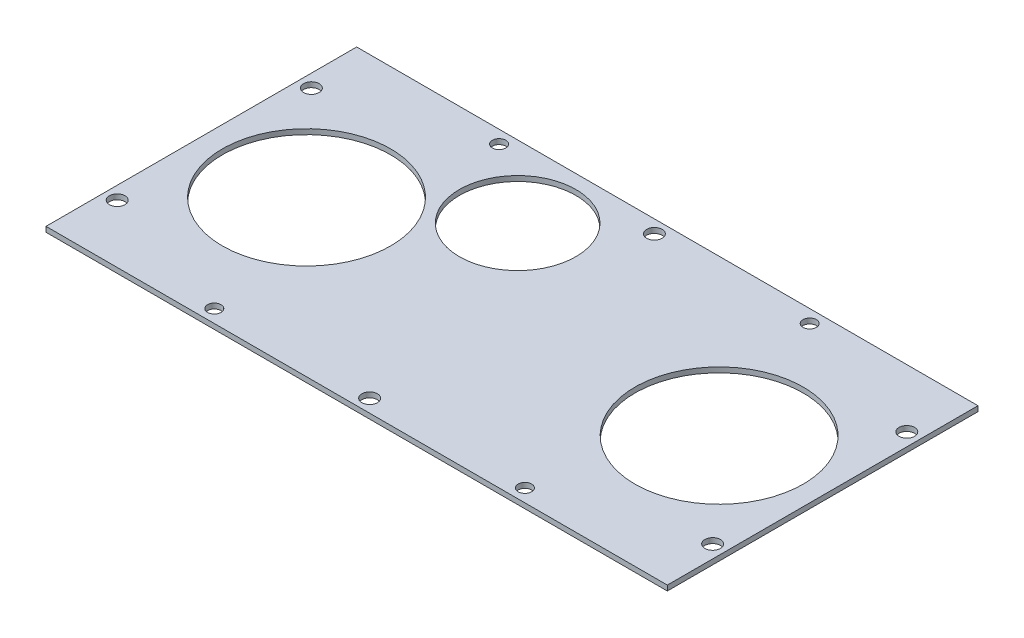
ISO-10303-21;
HEADER;
FILE_DESCRIPTION(('STEP AP214'),'2;1');
FILE_NAME('part.step','',(''),(''),'','','');
FILE_SCHEMA(('AUTOMOTIVE_DESIGN { 1 0 10303 214 1 1 1 1 }'));
ENDSEC;
DATA;
#1=APPLICATION_CONTEXT('core data for automotive mechanical design processes');
#2=APPLICATION_PROTOCOL_DEFINITION('international standard','automotive_design',2000,#1);
#3=PRODUCT_CONTEXT('',#1,'mechanical');
#4=PRODUCT('Part','Part','',(#3));
#5=PRODUCT_RELATED_PRODUCT_CATEGORY('part','',(#4));
#6=PRODUCT_DEFINITION_FORMATION('','',#4);
#7=PRODUCT_DEFINITION_CONTEXT('part definition',#1,'design');
#8=PRODUCT_DEFINITION('design','',#6,#7);
#9=PRODUCT_DEFINITION_SHAPE('','',#8);
#10=(LENGTH_UNIT() NAMED_UNIT(*) SI_UNIT(.MILLI.,.METRE.));
#11=(NAMED_UNIT(*) PLANE_ANGLE_UNIT() SI_UNIT($,.RADIAN.));
#12=(NAMED_UNIT(*) SI_UNIT($,.STERADIAN.) SOLID_ANGLE_UNIT());
#13=UNCERTAINTY_MEASURE_WITH_UNIT(LENGTH_MEASURE(1.E-05),#10,'distance_accuracy_value','');
#14=(GEOMETRIC_REPRESENTATION_CONTEXT(3) GLOBAL_UNCERTAINTY_ASSIGNED_CONTEXT((#13)) GLOBAL_UNIT_ASSIGNED_CONTEXT((#10,
#11,#12)) REPRESENTATION_CONTEXT('',''));
#15=CARTESIAN_POINT('',(0.,0.,0.));
#16=DIRECTION('',(0.,0.,1.));
#17=DIRECTION('',(1.,0.,0.));
#18=AXIS2_PLACEMENT_3D('',#15,#16,#17);
#19=CARTESIAN_POINT('',(0.,2.54,0.));
#20=DIRECTION('',(0.,1.,0.));
#21=DIRECTION('',(0.,0.,1.));
#22=AXIS2_PLACEMENT_3D('',#19,#20,#21);
#23=PLANE('',#22);
#24=CARTESIAN_POINT('',(-38.1,2.54,-40.8686));
#25=DIRECTION('',(0.,1.,0.));
#26=DIRECTION('',(0.,0.,1.));
#27=AXIS2_PLACEMENT_3D('',#24,#25,#26);
#28=CIRCLE('',#27,28.575);
#29=CARTESIAN_POINT('',(-38.1,2.54,-12.2936));
#30=VERTEX_POINT('',#29);
#31=EDGE_CURVE('E185',#30,#30,#28,.T.);
#32=ORIENTED_EDGE('',*,*,#31,.F.);
#33=EDGE_LOOP('',(#32));
#34=FACE_BOUND('',#33,.T.);
#35=CARTESIAN_POINT('',(146.05,2.54,47.625));
#36=DIRECTION('',(0.,1.,0.));
#37=DIRECTION('',(0.,0.,1.));
#38=AXIS2_PLACEMENT_3D('',#35,#36,#37);
#39=CIRCLE('',#38,3.81000000000001);
#40=CARTESIAN_POINT('',(146.05,2.54,51.435));
#41=VERTEX_POINT('',#40);
#42=EDGE_CURVE('E170',#41,#41,#39,.T.);
#43=ORIENTED_EDGE('',*,*,#42,.F.);
#44=EDGE_LOOP('',(#43));
#45=FACE_BOUND('',#44,.T.);
#46=CARTESIAN_POINT('',(-76.2,2.54,69.85));
#47=DIRECTION('',(0.,1.,0.));
#48=DIRECTION('',(0.,0.,1.));
#49=AXIS2_PLACEMENT_3D('',#46,#47,#48);
#50=CIRCLE('',#49,3.302);
#51=CARTESIAN_POINT('',(-76.2,2.54,73.152));
#52=VERTEX_POINT('',#51);
#53=EDGE_CURVE('E158',#52,#52,#50,.T.);
#54=ORIENTED_EDGE('',*,*,#53,.F.);
#55=EDGE_LOOP('',(#54));
#56=FACE_BOUND('',#55,.T.);
#57=CARTESIAN_POINT('',(-146.05,2.54,-47.625));
#58=DIRECTION('',(0.,1.,0.));
#59=DIRECTION('',(0.,0.,1.));
#60=AXIS2_PLACEMENT_3D('',#57,#58,#59);
#61=CIRCLE('',#60,3.81000000000001);
#62=CARTESIAN_POINT('',(-146.05,2.54,-43.815));
#63=VERTEX_POINT('',#62);
#64=EDGE_CURVE('E146',#63,#63,#61,.T.);
#65=ORIENTED_EDGE('',*,*,#64,.F.);
#66=EDGE_LOOP('',(#65));
#67=FACE_BOUND('',#66,.T.);
#68=CARTESIAN_POINT('',(146.05,2.54,-47.625));
#69=DIRECTION('',(0.,1.,0.));
#70=DIRECTION('',(0.,0.,1.));
#71=AXIS2_PLACEMENT_3D('',#68,#69,#70);
#72=CIRCLE('',#71,3.81000000000001);
#73=CARTESIAN_POINT('',(146.05,2.54,-43.815));
#74=VERTEX_POINT('',#73);
#75=EDGE_CURVE('E134',#74,#74,#72,.T.);
#76=ORIENTED_EDGE('',*,*,#75,.F.);
#77=EDGE_LOOP('',(#76));
#78=FACE_BOUND('',#77,.T.);
#79=CARTESIAN_POINT('',(-76.2,2.54,-69.85));
#80=DIRECTION('',(0.,1.,0.));
#81=DIRECTION('',(0.,0.,1.));
#82=AXIS2_PLACEMENT_3D('',#79,#80,#81);
#83=CIRCLE('',#82,3.302);
#84=CARTESIAN_POINT('',(-76.2,2.54,-66.548));
#85=VERTEX_POINT('',#84);
#86=EDGE_CURVE('E122',#85,#85,#83,.T.);
#87=ORIENTED_EDGE('',*,*,#86,.F.);
#88=EDGE_LOOP('',(#87));
#89=FACE_BOUND('',#88,.T.);
#90=CARTESIAN_POINT('',(0.,2.54,69.85));
#91=DIRECTION('',(0.,1.,0.));
#92=DIRECTION('',(0.,0.,1.));
#93=AXIS2_PLACEMENT_3D('',#90,#91,#92);
#94=CIRCLE('',#93,3.81);
#95=CARTESIAN_POINT('',(0.,2.54,73.66));
#96=VERTEX_POINT('',#95);
#97=EDGE_CURVE('E101',#96,#96,#94,.T.);
#98=ORIENTED_EDGE('',*,*,#97,.F.);
#99=EDGE_LOOP('',(#98));
#100=FACE_BOUND('',#99,.T.);
#101=DIRECTION('',(0.,0.,1.));
#102=VECTOR('',#101,1.);
#103=CARTESIAN_POINT('',(-152.4,2.54,-76.2));
#104=LINE('',#103,#102);
#105=CARTESIAN_POINT('',(-152.4,2.54,-76.2));
#106=VERTEX_POINT('',#105);
#107=CARTESIAN_POINT('',(-152.4,2.54,76.2));
#108=VERTEX_POINT('',#107);
#109=EDGE_CURVE('E86',#106,#108,#104,.T.);
#110=ORIENTED_EDGE('',*,*,#109,.T.);
#111=DIRECTION('',(1.,0.,0.));
#112=VECTOR('',#111,1.);
#113=CARTESIAN_POINT('',(-152.4,2.54,76.2));
#114=LINE('',#113,#112);
#115=CARTESIAN_POINT('',(152.4,2.54,76.2));
#116=VERTEX_POINT('',#115);
#117=EDGE_CURVE('E81',#108,#116,#114,.T.);
#118=ORIENTED_EDGE('',*,*,#117,.T.);
#119=DIRECTION('',(0.,0.,-1.));
#120=VECTOR('',#119,1.);
#121=CARTESIAN_POINT('',(152.4,2.54,-76.2));
#122=LINE('',#121,#120);
#123=CARTESIAN_POINT('',(152.4,2.54,-76.2));
#124=VERTEX_POINT('',#123);
#125=EDGE_CURVE('E84',#116,#124,#122,.T.);
#126=ORIENTED_EDGE('',*,*,#125,.T.);
#127=DIRECTION('',(-1.,0.,0.));
#128=VECTOR('',#127,1.);
#129=CARTESIAN_POINT('',(-152.4,2.54,-76.2));
#130=LINE('',#129,#128);
#131=EDGE_CURVE('E51',#124,#106,#130,.T.);
#132=ORIENTED_EDGE('',*,*,#131,.T.);
#133=EDGE_LOOP('',(#110,#118,#126,#132));
#134=FACE_BOUND('',#133,.T.);
#135=CARTESIAN_POINT('',(-100.803124951561,2.54,0.));
#136=DIRECTION('',(0.,1.,0.));
#137=DIRECTION('',(0.,0.,1.));
#138=AXIS2_PLACEMENT_3D('',#135,#136,#137);
#139=CIRCLE('',#138,41.275);
#140=CARTESIAN_POINT('',(-100.803124951561,2.54,41.275));
#141=VERTEX_POINT('',#140);
#142=EDGE_CURVE('E116',#141,#141,#139,.T.);
#143=ORIENTED_EDGE('',*,*,#142,.F.);
#144=EDGE_LOOP('',(#143));
#145=FACE_BOUND('',#144,.T.);
#146=CARTESIAN_POINT('',(101.6,2.54,0.));
#147=DIRECTION('',(0.,1.,0.));
#148=DIRECTION('',(0.,0.,1.));
#149=AXIS2_PLACEMENT_3D('',#146,#147,#148);
#150=CIRCLE('',#149,41.275);
#151=CARTESIAN_POINT('',(101.6,2.54,41.275));
#152=VERTEX_POINT('',#151);
#153=EDGE_CURVE('E128',#152,#152,#150,.T.);
#154=ORIENTED_EDGE('',*,*,#153,.F.);
#155=EDGE_LOOP('',(#154));
#156=FACE_BOUND('',#155,.T.);
#157=CARTESIAN_POINT('',(76.2,2.54,-69.85));
#158=DIRECTION('',(0.,1.,0.));
#159=DIRECTION('',(0.,0.,1.));
#160=AXIS2_PLACEMENT_3D('',#157,#158,#159);
#161=CIRCLE('',#160,3.302);
#162=CARTESIAN_POINT('',(76.2,2.54,-66.548));
#163=VERTEX_POINT('',#162);
#164=EDGE_CURVE('E140',#163,#163,#161,.T.);
#165=ORIENTED_EDGE('',*,*,#164,.F.);
#166=EDGE_LOOP('',(#165));
#167=FACE_BOUND('',#166,.T.);
#168=CARTESIAN_POINT('',(-146.05,2.54,47.625));
#169=DIRECTION('',(0.,1.,0.));
#170=DIRECTION('',(0.,0.,1.));
#171=AXIS2_PLACEMENT_3D('',#168,#169,#170);
#172=CIRCLE('',#171,3.81000000000001);
#173=CARTESIAN_POINT('',(-146.05,2.54,51.435));
#174=VERTEX_POINT('',#173);
#175=EDGE_CURVE('E152',#174,#174,#172,.T.);
#176=ORIENTED_EDGE('',*,*,#175,.F.);
#177=EDGE_LOOP('',(#176));
#178=FACE_BOUND('',#177,.T.);
#179=CARTESIAN_POINT('',(76.2,2.54,69.85));
#180=DIRECTION('',(0.,1.,0.));
#181=DIRECTION('',(0.,0.,1.));
#182=AXIS2_PLACEMENT_3D('',#179,#180,#181);
#183=CIRCLE('',#182,3.302);
#184=CARTESIAN_POINT('',(76.2,2.54,73.152));
#185=VERTEX_POINT('',#184);
#186=EDGE_CURVE('E164',#185,#185,#183,.T.);
#187=ORIENTED_EDGE('',*,*,#186,.F.);
#188=EDGE_LOOP('',(#187));
#189=FACE_BOUND('',#188,.T.);
#190=CARTESIAN_POINT('',(0.,2.54,-69.85));
#191=DIRECTION('',(0.,1.,0.));
#192=DIRECTION('',(0.,0.,1.));
#193=AXIS2_PLACEMENT_3D('',#190,#191,#192);
#194=CIRCLE('',#193,3.81);
#195=CARTESIAN_POINT('',(0.,2.54,-66.04));
#196=VERTEX_POINT('',#195);
#197=EDGE_CURVE('E176',#196,#196,#194,.T.);
#198=ORIENTED_EDGE('',*,*,#197,.F.);
#199=EDGE_LOOP('',(#198));
#200=FACE_BOUND('',#199,.T.);
#201=ADVANCED_FACE('F34',(#34,#45,#56,#67,#78,#89,#100,#134,#145,#156,#167,#178,#189,#200),#23,.T.);
#202=CARTESIAN_POINT('',(0.,0.,0.));
#203=DIRECTION('',(0.,1.,0.));
#204=DIRECTION('',(0.,0.,1.));
#205=AXIS2_PLACEMENT_3D('',#202,#203,#204);
#206=PLANE('',#205);
#207=CARTESIAN_POINT('',(-38.1,0.,-40.8686));
#208=DIRECTION('',(0.,1.,0.));
#209=DIRECTION('',(0.,0.,1.));
#210=AXIS2_PLACEMENT_3D('',#207,#208,#209);
#211=CIRCLE('',#210,28.575);
#212=CARTESIAN_POINT('',(-38.1,0.,-12.2936));
#213=VERTEX_POINT('',#212);
#214=EDGE_CURVE('E182',#213,#213,#211,.T.);
#215=ORIENTED_EDGE('',*,*,#214,.T.);
#216=EDGE_LOOP('',(#215));
#217=FACE_BOUND('',#216,.T.);
#218=CARTESIAN_POINT('',(146.05,0.,47.625));
#219=DIRECTION('',(0.,1.,0.));
#220=DIRECTION('',(0.,0.,1.));
#221=AXIS2_PLACEMENT_3D('',#218,#219,#220);
#222=CIRCLE('',#221,3.81000000000001);
#223=CARTESIAN_POINT('',(146.05,0.,51.435));
#224=VERTEX_POINT('',#223);
#225=EDGE_CURVE('E173',#224,#224,#222,.T.);
#226=ORIENTED_EDGE('',*,*,#225,.T.);
#227=EDGE_LOOP('',(#226));
#228=FACE_BOUND('',#227,.T.);
#229=CARTESIAN_POINT('',(-76.2,0.,69.85));
#230=DIRECTION('',(0.,1.,0.));
#231=DIRECTION('',(0.,0.,1.));
#232=AXIS2_PLACEMENT_3D('',#229,#230,#231);
#233=CIRCLE('',#232,3.302);
#234=CARTESIAN_POINT('',(-76.2,0.,73.152));
#235=VERTEX_POINT('',#234);
#236=EDGE_CURVE('E161',#235,#235,#233,.T.);
#237=ORIENTED_EDGE('',*,*,#236,.T.);
#238=EDGE_LOOP('',(#237));
#239=FACE_BOUND('',#238,.T.);
#240=CARTESIAN_POINT('',(-146.05,0.,-47.625));
#241=DIRECTION('',(0.,1.,0.));
#242=DIRECTION('',(0.,0.,1.));
#243=AXIS2_PLACEMENT_3D('',#240,#241,#242);
#244=CIRCLE('',#243,3.81000000000001);
#245=CARTESIAN_POINT('',(-146.05,0.,-43.815));
#246=VERTEX_POINT('',#245);
#247=EDGE_CURVE('E149',#246,#246,#244,.T.);
#248=ORIENTED_EDGE('',*,*,#247,.T.);
#249=EDGE_LOOP('',(#248));
#250=FACE_BOUND('',#249,.T.);
#251=CARTESIAN_POINT('',(146.05,0.,-47.625));
#252=DIRECTION('',(0.,1.,0.));
#253=DIRECTION('',(0.,0.,1.));
#254=AXIS2_PLACEMENT_3D('',#251,#252,#253);
#255=CIRCLE('',#254,3.81000000000001);
#256=CARTESIAN_POINT('',(146.05,0.,-43.815));
#257=VERTEX_POINT('',#256);
#258=EDGE_CURVE('E137',#257,#257,#255,.T.);
#259=ORIENTED_EDGE('',*,*,#258,.T.);
#260=EDGE_LOOP('',(#259));
#261=FACE_BOUND('',#260,.T.);
#262=CARTESIAN_POINT('',(-76.2,0.,-69.85));
#263=DIRECTION('',(0.,1.,0.));
#264=DIRECTION('',(0.,0.,1.));
#265=AXIS2_PLACEMENT_3D('',#262,#263,#264);
#266=CIRCLE('',#265,3.302);
#267=CARTESIAN_POINT('',(-76.2,0.,-66.548));
#268=VERTEX_POINT('',#267);
#269=EDGE_CURVE('E125',#268,#268,#266,.T.);
#270=ORIENTED_EDGE('',*,*,#269,.T.);
#271=EDGE_LOOP('',(#270));
#272=FACE_BOUND('',#271,.T.);
#273=CARTESIAN_POINT('',(0.,0.,69.85));
#274=DIRECTION('',(0.,1.,0.));
#275=DIRECTION('',(0.,0.,1.));
#276=AXIS2_PLACEMENT_3D('',#273,#274,#275);
#277=CIRCLE('',#276,3.81);
#278=CARTESIAN_POINT('',(0.,0.,73.66));
#279=VERTEX_POINT('',#278);
#280=EDGE_CURVE('E113',#279,#279,#277,.T.);
#281=ORIENTED_EDGE('',*,*,#280,.T.);
#282=EDGE_LOOP('',(#281));
#283=FACE_BOUND('',#282,.T.);
#284=DIRECTION('',(0.,0.,1.));
#285=VECTOR('',#284,1.);
#286=CARTESIAN_POINT('',(-152.4,0.,-76.2));
#287=LINE('',#286,#285);
#288=CARTESIAN_POINT('',(-152.4,0.,-76.2));
#289=VERTEX_POINT('',#288);
#290=CARTESIAN_POINT('',(-152.4,0.,76.2));
#291=VERTEX_POINT('',#290);
#292=EDGE_CURVE('E98',#289,#291,#287,.T.);
#293=ORIENTED_EDGE('',*,*,#292,.F.);
#294=DIRECTION('',(-1.,0.,0.));
#295=VECTOR('',#294,1.);
#296=CARTESIAN_POINT('',(-152.4,0.,-76.2));
#297=LINE('',#296,#295);
#298=CARTESIAN_POINT('',(152.4,0.,-76.2));
#299=VERTEX_POINT('',#298);
#300=EDGE_CURVE('E74',#299,#289,#297,.T.);
#301=ORIENTED_EDGE('',*,*,#300,.F.);
#302=DIRECTION('',(0.,0.,-1.));
#303=VECTOR('',#302,1.);
#304=CARTESIAN_POINT('',(152.4,0.,-76.2));
#305=LINE('',#304,#303);
#306=CARTESIAN_POINT('',(152.4,0.,76.2));
#307=VERTEX_POINT('',#306);
#308=EDGE_CURVE('E68',#307,#299,#305,.T.);
#309=ORIENTED_EDGE('',*,*,#308,.F.);
#310=DIRECTION('',(1.,0.,0.));
#311=VECTOR('',#310,1.);
#312=CARTESIAN_POINT('',(-152.4,0.,76.2));
#313=LINE('',#312,#311);
#314=EDGE_CURVE('E90',#291,#307,#313,.T.);
#315=ORIENTED_EDGE('',*,*,#314,.F.);
#316=EDGE_LOOP('',(#293,#301,#309,#315));
#317=FACE_BOUND('',#316,.T.);
#318=CARTESIAN_POINT('',(-100.803124951561,0.,0.));
#319=DIRECTION('',(0.,1.,0.));
#320=DIRECTION('',(0.,0.,1.));
#321=AXIS2_PLACEMENT_3D('',#318,#319,#320);
#322=CIRCLE('',#321,41.275);
#323=CARTESIAN_POINT('',(-100.803124951561,0.,41.275));
#324=VERTEX_POINT('',#323);
#325=EDGE_CURVE('E119',#324,#324,#322,.T.);
#326=ORIENTED_EDGE('',*,*,#325,.T.);
#327=EDGE_LOOP('',(#326));
#328=FACE_BOUND('',#327,.T.);
#329=CARTESIAN_POINT('',(101.6,0.,0.));
#330=DIRECTION('',(0.,1.,0.));
#331=DIRECTION('',(0.,0.,1.));
#332=AXIS2_PLACEMENT_3D('',#329,#330,#331);
#333=CIRCLE('',#332,41.275);
#334=CARTESIAN_POINT('',(101.6,0.,41.275));
#335=VERTEX_POINT('',#334);
#336=EDGE_CURVE('E131',#335,#335,#333,.T.);
#337=ORIENTED_EDGE('',*,*,#336,.T.);
#338=EDGE_LOOP('',(#337));
#339=FACE_BOUND('',#338,.T.);
#340=CARTESIAN_POINT('',(76.2,0.,-69.85));
#341=DIRECTION('',(0.,1.,0.));
#342=DIRECTION('',(0.,0.,1.));
#343=AXIS2_PLACEMENT_3D('',#340,#341,#342);
#344=CIRCLE('',#343,3.302);
#345=CARTESIAN_POINT('',(76.2,0.,-66.548));
#346=VERTEX_POINT('',#345);
#347=EDGE_CURVE('E143',#346,#346,#344,.T.);
#348=ORIENTED_EDGE('',*,*,#347,.T.);
#349=EDGE_LOOP('',(#348));
#350=FACE_BOUND('',#349,.T.);
#351=CARTESIAN_POINT('',(-146.05,0.,47.625));
#352=DIRECTION('',(0.,1.,0.));
#353=DIRECTION('',(0.,0.,1.));
#354=AXIS2_PLACEMENT_3D('',#351,#352,#353);
#355=CIRCLE('',#354,3.81000000000001);
#356=CARTESIAN_POINT('',(-146.05,0.,51.435));
#357=VERTEX_POINT('',#356);
#358=EDGE_CURVE('E155',#357,#357,#355,.T.);
#359=ORIENTED_EDGE('',*,*,#358,.T.);
#360=EDGE_LOOP('',(#359));
#361=FACE_BOUND('',#360,.T.);
#362=CARTESIAN_POINT('',(76.2,0.,69.85));
#363=DIRECTION('',(0.,1.,0.));
#364=DIRECTION('',(0.,0.,1.));
#365=AXIS2_PLACEMENT_3D('',#362,#363,#364);
#366=CIRCLE('',#365,3.302);
#367=CARTESIAN_POINT('',(76.2,0.,73.152));
#368=VERTEX_POINT('',#367);
#369=EDGE_CURVE('E167',#368,#368,#366,.T.);
#370=ORIENTED_EDGE('',*,*,#369,.T.);
#371=EDGE_LOOP('',(#370));
#372=FACE_BOUND('',#371,.T.);
#373=CARTESIAN_POINT('',(0.,0.,-69.85));
#374=DIRECTION('',(0.,1.,0.));
#375=DIRECTION('',(0.,0.,1.));
#376=AXIS2_PLACEMENT_3D('',#373,#374,#375);
#377=CIRCLE('',#376,3.81);
#378=CARTESIAN_POINT('',(0.,0.,-66.04));
#379=VERTEX_POINT('',#378);
#380=EDGE_CURVE('E179',#379,#379,#377,.T.);
#381=ORIENTED_EDGE('',*,*,#380,.T.);
#382=EDGE_LOOP('',(#381));
#383=FACE_BOUND('',#382,.T.);
#384=ADVANCED_FACE('F109',(#217,#228,#239,#250,#261,#272,#283,#317,#328,#339,#350,#361,#372,
#383),#206,.F.);
#385=CARTESIAN_POINT('',(-152.4,2.54,-76.2));
#386=DIRECTION('',(1.,0.,0.));
#387=DIRECTION('',(0.,0.,-1.));
#388=AXIS2_PLACEMENT_3D('',#385,#386,#387);
#389=PLANE('',#388);
#390=ORIENTED_EDGE('',*,*,#292,.T.);
#391=DIRECTION('',(0.,-1.,0.));
#392=VECTOR('',#391,1.);
#393=CARTESIAN_POINT('',(-152.4,2.54,76.2));
#394=LINE('',#393,#392);
#395=EDGE_CURVE('E11',#108,#291,#394,.T.);
#396=ORIENTED_EDGE('',*,*,#395,.F.);
#397=ORIENTED_EDGE('',*,*,#109,.F.);
#398=DIRECTION('',(0.,-1.,0.));
#399=VECTOR('',#398,1.);
#400=CARTESIAN_POINT('',(-152.4,2.54,-76.2));
#401=LINE('',#400,#399);
#402=EDGE_CURVE('E94',#106,#289,#401,.T.);
#403=ORIENTED_EDGE('',*,*,#402,.T.);
#404=EDGE_LOOP('',(#390,#396,#397,#403));
#405=FACE_BOUND('',#404,.T.);
#406=ADVANCED_FACE('F36',(#405),#389,.F.);
#407=CARTESIAN_POINT('',(-152.4,2.54,76.2));
#408=DIRECTION('',(0.,0.,-1.));
#409=DIRECTION('',(-1.,0.,0.));
#410=AXIS2_PLACEMENT_3D('',#407,#408,#409);
#411=PLANE('',#410);
#412=ORIENTED_EDGE('',*,*,#314,.T.);
#413=DIRECTION('',(0.,-1.,0.));
#414=VECTOR('',#413,1.);
#415=CARTESIAN_POINT('',(152.4,2.54,76.2));
#416=LINE('',#415,#414);
#417=EDGE_CURVE('E43',#116,#307,#416,.T.);
#418=ORIENTED_EDGE('',*,*,#417,.F.);
#419=ORIENTED_EDGE('',*,*,#117,.F.);
#420=ORIENTED_EDGE('',*,*,#395,.T.);
#421=EDGE_LOOP('',(#412,#418,#419,#420));
#422=FACE_BOUND('',#421,.T.);
#423=ADVANCED_FACE('F89',(#422),#411,.F.);
#424=CARTESIAN_POINT('',(152.4,2.54,-76.2));
#425=DIRECTION('',(-1.,0.,0.));
#426=DIRECTION('',(0.,0.,1.));
#427=AXIS2_PLACEMENT_3D('',#424,#425,#426);
#428=PLANE('',#427);
#429=ORIENTED_EDGE('',*,*,#308,.T.);
#430=DIRECTION('',(0.,-1.,0.));
#431=VECTOR('',#430,1.);
#432=CARTESIAN_POINT('',(152.4,2.54,-76.2));
#433=LINE('',#432,#431);
#434=EDGE_CURVE('E91',#124,#299,#433,.T.);
#435=ORIENTED_EDGE('',*,*,#434,.F.);
#436=ORIENTED_EDGE('',*,*,#125,.F.);
#437=ORIENTED_EDGE('',*,*,#417,.T.);
#438=EDGE_LOOP('',(#429,#435,#436,#437));
#439=FACE_BOUND('',#438,.T.);
#440=ADVANCED_FACE('F92',(#439),#428,.F.);
#441=CARTESIAN_POINT('',(-152.4,2.54,-76.2));
#442=DIRECTION('',(0.,0.,1.));
#443=DIRECTION('',(1.,0.,0.));
#444=AXIS2_PLACEMENT_3D('',#441,#442,#443);
#445=PLANE('',#444);
#446=ORIENTED_EDGE('',*,*,#300,.T.);
#447=ORIENTED_EDGE('',*,*,#402,.F.);
#448=ORIENTED_EDGE('',*,*,#131,.F.);
#449=ORIENTED_EDGE('',*,*,#434,.T.);
#450=EDGE_LOOP('',(#446,#447,#448,#449));
#451=FACE_BOUND('',#450,.T.);
#452=ADVANCED_FACE('F106',(#451),#445,.F.);
#453=CARTESIAN_POINT('',(0.,2.54,69.85));
#454=DIRECTION('',(0.,-1.,0.));
#455=DIRECTION('',(0.,0.,-1.));
#456=AXIS2_PLACEMENT_3D('',#453,#454,#455);
#457=CYLINDRICAL_SURFACE('',#456,3.81);
#458=ORIENTED_EDGE('',*,*,#97,.T.);
#459=EDGE_LOOP('',(#458));
#460=FACE_BOUND('',#459,.T.);
#461=ORIENTED_EDGE('',*,*,#280,.F.);
#462=EDGE_LOOP('',(#461));
#463=FACE_BOUND('',#462,.T.);
#464=ADVANCED_FACE('F215',(#460,#463),#457,.F.);
#465=CARTESIAN_POINT('',(-100.803124951561,2.54,0.));
#466=DIRECTION('',(0.,-1.,0.));
#467=DIRECTION('',(0.,0.,-1.));
#468=AXIS2_PLACEMENT_3D('',#465,#466,#467);
#469=CYLINDRICAL_SURFACE('',#468,41.275);
#470=ORIENTED_EDGE('',*,*,#142,.T.);
#471=EDGE_LOOP('',(#470));
#472=FACE_BOUND('',#471,.T.);
#473=ORIENTED_EDGE('',*,*,#325,.F.);
#474=EDGE_LOOP('',(#473));
#475=FACE_BOUND('',#474,.T.);
#476=ADVANCED_FACE('F218',(#472,#475),#469,.F.);
#477=CARTESIAN_POINT('',(-76.2,2.54,-69.85));
#478=DIRECTION('',(0.,-1.,0.));
#479=DIRECTION('',(0.,0.,-1.));
#480=AXIS2_PLACEMENT_3D('',#477,#478,#479);
#481=CYLINDRICAL_SURFACE('',#480,3.302);
#482=ORIENTED_EDGE('',*,*,#86,.T.);
#483=EDGE_LOOP('',(#482));
#484=FACE_BOUND('',#483,.T.);
#485=ORIENTED_EDGE('',*,*,#269,.F.);
#486=EDGE_LOOP('',(#485));
#487=FACE_BOUND('',#486,.T.);
#488=ADVANCED_FACE('F254',(#484,#487),#481,.F.);
#489=CARTESIAN_POINT('',(101.6,2.54,0.));
#490=DIRECTION('',(0.,-1.,0.));
#491=DIRECTION('',(0.,0.,-1.));
#492=AXIS2_PLACEMENT_3D('',#489,#490,#491);
#493=CYLINDRICAL_SURFACE('',#492,41.275);
#494=ORIENTED_EDGE('',*,*,#153,.T.);
#495=EDGE_LOOP('',(#494));
#496=FACE_BOUND('',#495,.T.);
#497=ORIENTED_EDGE('',*,*,#336,.F.);
#498=EDGE_LOOP('',(#497));
#499=FACE_BOUND('',#498,.T.);
#500=ADVANCED_FACE('F262',(#496,#499),#493,.F.);
#501=CARTESIAN_POINT('',(146.05,2.54,-47.625));
#502=DIRECTION('',(0.,-1.,0.));
#503=DIRECTION('',(0.,0.,-1.));
#504=AXIS2_PLACEMENT_3D('',#501,#502,#503);
#505=CYLINDRICAL_SURFACE('',#504,3.81000000000001);
#506=ORIENTED_EDGE('',*,*,#75,.T.);
#507=EDGE_LOOP('',(#506));
#508=FACE_BOUND('',#507,.T.);
#509=ORIENTED_EDGE('',*,*,#258,.F.);
#510=EDGE_LOOP('',(#509));
#511=FACE_BOUND('',#510,.T.);
#512=ADVANCED_FACE('F270',(#508,#511),#505,.F.);
#513=CARTESIAN_POINT('',(76.2,2.54,-69.85));
#514=DIRECTION('',(0.,-1.,0.));
#515=DIRECTION('',(0.,0.,-1.));
#516=AXIS2_PLACEMENT_3D('',#513,#514,#515);
#517=CYLINDRICAL_SURFACE('',#516,3.302);
#518=ORIENTED_EDGE('',*,*,#164,.T.);
#519=EDGE_LOOP('',(#518));
#520=FACE_BOUND('',#519,.T.);
#521=ORIENTED_EDGE('',*,*,#347,.F.);
#522=EDGE_LOOP('',(#521));
#523=FACE_BOUND('',#522,.T.);
#524=ADVANCED_FACE('F278',(#520,#523),#517,.F.);
#525=CARTESIAN_POINT('',(-146.05,2.54,-47.625));
#526=DIRECTION('',(0.,-1.,0.));
#527=DIRECTION('',(0.,0.,-1.));
#528=AXIS2_PLACEMENT_3D('',#525,#526,#527);
#529=CYLINDRICAL_SURFACE('',#528,3.81000000000001);
#530=ORIENTED_EDGE('',*,*,#64,.T.);
#531=EDGE_LOOP('',(#530));
#532=FACE_BOUND('',#531,.T.);
#533=ORIENTED_EDGE('',*,*,#247,.F.);
#534=EDGE_LOOP('',(#533));
#535=FACE_BOUND('',#534,.T.);
#536=ADVANCED_FACE('F286',(#532,#535),#529,.F.);
#537=CARTESIAN_POINT('',(-146.05,2.54,47.625));
#538=DIRECTION('',(0.,-1.,0.));
#539=DIRECTION('',(0.,0.,-1.));
#540=AXIS2_PLACEMENT_3D('',#537,#538,#539);
#541=CYLINDRICAL_SURFACE('',#540,3.81000000000001);
#542=ORIENTED_EDGE('',*,*,#175,.T.);
#543=EDGE_LOOP('',(#542));
#544=FACE_BOUND('',#543,.T.);
#545=ORIENTED_EDGE('',*,*,#358,.F.);
#546=EDGE_LOOP('',(#545));
#547=FACE_BOUND('',#546,.T.);
#548=ADVANCED_FACE('F294',(#544,#547),#541,.F.);
#549=CARTESIAN_POINT('',(-76.2,2.54,69.85));
#550=DIRECTION('',(0.,-1.,0.));
#551=DIRECTION('',(0.,0.,-1.));
#552=AXIS2_PLACEMENT_3D('',#549,#550,#551);
#553=CYLINDRICAL_SURFACE('',#552,3.302);
#554=ORIENTED_EDGE('',*,*,#53,.T.);
#555=EDGE_LOOP('',(#554));
#556=FACE_BOUND('',#555,.T.);
#557=ORIENTED_EDGE('',*,*,#236,.F.);
#558=EDGE_LOOP('',(#557));
#559=FACE_BOUND('',#558,.T.);
#560=ADVANCED_FACE('F302',(#556,#559),#553,.F.);
#561=CARTESIAN_POINT('',(76.2,2.54,69.85));
#562=DIRECTION('',(0.,-1.,0.));
#563=DIRECTION('',(0.,0.,-1.));
#564=AXIS2_PLACEMENT_3D('',#561,#562,#563);
#565=CYLINDRICAL_SURFACE('',#564,3.302);
#566=ORIENTED_EDGE('',*,*,#186,.T.);
#567=EDGE_LOOP('',(#566));
#568=FACE_BOUND('',#567,.T.);
#569=ORIENTED_EDGE('',*,*,#369,.F.);
#570=EDGE_LOOP('',(#569));
#571=FACE_BOUND('',#570,.T.);
#572=ADVANCED_FACE('F310',(#568,#571),#565,.F.);
#573=CARTESIAN_POINT('',(146.05,2.54,47.625));
#574=DIRECTION('',(0.,-1.,0.));
#575=DIRECTION('',(0.,0.,-1.));
#576=AXIS2_PLACEMENT_3D('',#573,#574,#575);
#577=CYLINDRICAL_SURFACE('',#576,3.81000000000001);
#578=ORIENTED_EDGE('',*,*,#42,.T.);
#579=EDGE_LOOP('',(#578));
#580=FACE_BOUND('',#579,.T.);
#581=ORIENTED_EDGE('',*,*,#225,.F.);
#582=EDGE_LOOP('',(#581));
#583=FACE_BOUND('',#582,.T.);
#584=ADVANCED_FACE('F318',(#580,#583),#577,.F.);
#585=CARTESIAN_POINT('',(0.,2.54,-69.85));
#586=DIRECTION('',(0.,-1.,0.));
#587=DIRECTION('',(0.,0.,-1.));
#588=AXIS2_PLACEMENT_3D('',#585,#586,#587);
#589=CYLINDRICAL_SURFACE('',#588,3.81);
#590=ORIENTED_EDGE('',*,*,#197,.T.);
#591=EDGE_LOOP('',(#590));
#592=FACE_BOUND('',#591,.T.);
#593=ORIENTED_EDGE('',*,*,#380,.F.);
#594=EDGE_LOOP('',(#593));
#595=FACE_BOUND('',#594,.T.);
#596=ADVANCED_FACE('F196',(#592,#595),#589,.F.);
#597=CARTESIAN_POINT('',(-38.1,0.,-40.8686));
#598=DIRECTION('',(0.,1.,0.));
#599=DIRECTION('',(0.,0.,1.));
#600=AXIS2_PLACEMENT_3D('',#597,#598,#599);
#601=CYLINDRICAL_SURFACE('',#600,28.575);
#602=ORIENTED_EDGE('',*,*,#214,.F.);
#603=EDGE_LOOP('',(#602));
#604=FACE_BOUND('',#603,.T.);
#605=ORIENTED_EDGE('',*,*,#31,.T.);
#606=EDGE_LOOP('',(#605));
#607=FACE_BOUND('',#606,.T.);
#608=ADVANCED_FACE('F193',(#604,#607),#601,.F.);
#609=CLOSED_SHELL('',(#201,#384,#406,#423,#440,#452,#464,#476,#488,#500,#512,#524,#536,#548,
#560,#572,#584,#596,#608));
#610=MANIFOLD_SOLID_BREP('B2',#609);
#611=ADVANCED_BREP_SHAPE_REPRESENTATION('',(#18,#610),#14);
#612=SHAPE_DEFINITION_REPRESENTATION(#9,#611);
ENDSEC;
END-ISO-10303-21;
